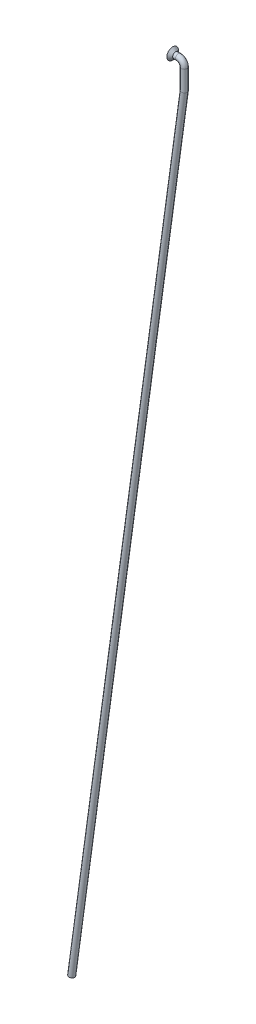
ISO-10303-21;
HEADER;
FILE_DESCRIPTION(('STEP AP214'),'2;1');
FILE_NAME('part.step','',(''),(''),'','','');
FILE_SCHEMA(('AUTOMOTIVE_DESIGN { 1 0 10303 214 1 1 1 1 }'));
ENDSEC;
DATA;
#1=APPLICATION_CONTEXT('core data for automotive mechanical design processes');
#2=APPLICATION_PROTOCOL_DEFINITION('international standard','automotive_design',2000,#1);
#3=PRODUCT_CONTEXT('',#1,'mechanical');
#4=PRODUCT('Part','Part','',(#3));
#5=PRODUCT_RELATED_PRODUCT_CATEGORY('part','',(#4));
#6=PRODUCT_DEFINITION_FORMATION('','',#4);
#7=PRODUCT_DEFINITION_CONTEXT('part definition',#1,'design');
#8=PRODUCT_DEFINITION('design','',#6,#7);
#9=PRODUCT_DEFINITION_SHAPE('','',#8);
#10=(LENGTH_UNIT() NAMED_UNIT(*) SI_UNIT(.MILLI.,.METRE.));
#11=(NAMED_UNIT(*) PLANE_ANGLE_UNIT() SI_UNIT($,.RADIAN.));
#12=(NAMED_UNIT(*) SI_UNIT($,.STERADIAN.) SOLID_ANGLE_UNIT());
#13=UNCERTAINTY_MEASURE_WITH_UNIT(LENGTH_MEASURE(1.E-05),#10,'distance_accuracy_value','');
#14=(GEOMETRIC_REPRESENTATION_CONTEXT(3) GLOBAL_UNCERTAINTY_ASSIGNED_CONTEXT((#13)) GLOBAL_UNIT_ASSIGNED_CONTEXT((#10,
#11,#12)) REPRESENTATION_CONTEXT('',''));
#15=CARTESIAN_POINT('',(0.,0.,0.));
#16=DIRECTION('',(0.,0.,1.));
#17=DIRECTION('',(1.,0.,0.));
#18=AXIS2_PLACEMENT_3D('',#15,#16,#17);
#19=CARTESIAN_POINT('',(1.17961196366423E-13,-9.00000000000038,0.));
#20=DIRECTION('',(-0.135542652249381,-0.990771512217255,0.));
#21=DIRECTION('',(0.990771512217224,-0.135542652249385,0.));
#22=AXIS2_PLACEMENT_3D('',#19,#20,#21);
#23=CYLINDRICAL_SURFACE('',#22,0.999999999999998);
#24=CARTESIAN_POINT('',(1.17961196366423E-13,-9.00000000000038,0.));
#25=DIRECTION('',(-0.0679282260285678,-0.997690210490551,0.));
#26=DIRECTION('',(0.997690210490517,-0.0679282260285706,0.));
#27=AXIS2_PLACEMENT_3D('',#24,#25,#26);
#28=ELLIPSE('',#27,1.00231513698861,0.999999999999998);
#29=CARTESIAN_POINT('',(1.00000000000012,-9.0680854891776,0.));
#30=VERTEX_POINT('',#29);
#31=EDGE_CURVE('E37',#30,#30,#28,.F.);
#32=ORIENTED_EDGE('',*,*,#31,.F.);
#33=EDGE_LOOP('',(#32));
#34=FACE_BOUND('',#33,.T.);
#35=CARTESIAN_POINT('',(-38.7761143552905,-292.440443433379,0.));
#36=DIRECTION('',(-0.135542652249381,-0.990771512217256,0.));
#37=DIRECTION('',(0.990771512217223,-0.135542652249385,0.));
#38=AXIS2_PLACEMENT_3D('',#35,#36,#37);
#39=CIRCLE('',#38,0.999999999999998);
#40=CARTESIAN_POINT('',(-37.7853428430733,-292.575986085628,0.));
#41=VERTEX_POINT('',#40);
#42=EDGE_CURVE('E11',#41,#41,#39,.T.);
#43=ORIENTED_EDGE('',*,*,#42,.F.);
#44=EDGE_LOOP('',(#43));
#45=FACE_BOUND('',#44,.T.);
#46=ADVANCED_FACE('F31',(#34,#45),#23,.T.);
#47=CARTESIAN_POINT('',(1.17961196366423E-13,-2.00000000000001,0.));
#48=DIRECTION('',(0.,-1.00000000000003,0.));
#49=DIRECTION('',(1.,0.,0.));
#50=AXIS2_PLACEMENT_3D('',#47,#48,#49);
#51=CYLINDRICAL_SURFACE('',#50,0.999999999999998);
#52=CARTESIAN_POINT('',(1.17961196366423E-13,-2.00000000000001,0.));
#53=DIRECTION('',(0.,-1.00000000000003,0.));
#54=DIRECTION('',(0.,0.,-1.00000000000003));
#55=AXIS2_PLACEMENT_3D('',#52,#53,#54);
#56=CIRCLE('',#55,0.999999999999998);
#57=CARTESIAN_POINT('',(1.00000000000011,-2.00000000000001,0.));
#58=VERTEX_POINT('',#57);
#59=EDGE_CURVE('E41',#58,#58,#56,.T.);
#60=ORIENTED_EDGE('',*,*,#59,.T.);
#61=EDGE_LOOP('',(#60));
#62=FACE_BOUND('',#61,.T.);
#63=ORIENTED_EDGE('',*,*,#31,.T.);
#64=EDGE_LOOP('',(#63));
#65=FACE_BOUND('',#64,.T.);
#66=ADVANCED_FACE('F74',(#62,#65),#51,.T.);
#67=CARTESIAN_POINT('',(-1.99999999999988,-2.00000000000003,0.));
#68=DIRECTION('',(0.,0.,-1.00000000000003));
#69=DIRECTION('',(-1.,0.,0.));
#70=AXIS2_PLACEMENT_3D('',#67,#68,#69);
#71=TOROIDAL_SURFACE('',#70,2.,0.999999999999998);
#72=CARTESIAN_POINT('',(-1.99999999999988,0.,0.));
#73=DIRECTION('',(1.,0.,0.));
#74=DIRECTION('',(0.,0.,-1.00000000000003));
#75=AXIS2_PLACEMENT_3D('',#72,#73,#74);
#76=CIRCLE('',#75,0.999999999999998);
#77=CARTESIAN_POINT('',(-1.99999999999988,0.999999999999972,0.));
#78=VERTEX_POINT('',#77);
#79=EDGE_CURVE('E45',#78,#78,#76,.T.);
#80=CARTESIAN_POINT('',(-1.99999999999988,-2.00000000000003,0.));
#81=DIRECTION('',(0.,0.,-1.00000000000003));
#82=DIRECTION('',(-1.,0.,0.));
#83=AXIS2_PLACEMENT_3D('',#80,#81,#82);
#84=CIRCLE('',#83,3.);
#85=EDGE_CURVE('',#78,#58,#84,.T.);
#86=ORIENTED_EDGE('',*,*,#79,.T.);
#87=ORIENTED_EDGE('',*,*,#59,.F.);
#88=ORIENTED_EDGE('',*,*,#85,.T.);
#89=ORIENTED_EDGE('',*,*,#85,.F.);
#90=EDGE_LOOP('',(#86,#88,#87,#89));
#91=FACE_BOUND('',#90,.T.);
#92=ADVANCED_FACE('F79',(#91),#71,.T.);
#93=CARTESIAN_POINT('',(-1.99999999999988,0.,0.));
#94=DIRECTION('',(-1.,0.,0.));
#95=DIRECTION('',(0.,-1.00000000000003,0.));
#96=AXIS2_PLACEMENT_3D('',#93,#94,#95);
#97=CYLINDRICAL_SURFACE('',#96,0.999999999999998);
#98=CARTESIAN_POINT('',(-2.99999999999988,0.,0.));
#99=DIRECTION('',(1.,0.,0.));
#100=DIRECTION('',(0.,1.00000000000003,0.));
#101=AXIS2_PLACEMENT_3D('',#98,#99,#100);
#102=CIRCLE('',#101,0.999999999999999);
#103=CARTESIAN_POINT('',(-2.99999999999988,1.00000000000003,0.));
#104=VERTEX_POINT('',#103);
#105=EDGE_CURVE('E53',#104,#104,#102,.T.);
#106=ORIENTED_EDGE('',*,*,#105,.T.);
#107=EDGE_LOOP('',(#106));
#108=FACE_BOUND('',#107,.T.);
#109=ORIENTED_EDGE('',*,*,#79,.F.);
#110=EDGE_LOOP('',(#109));
#111=FACE_BOUND('',#110,.T.);
#112=ADVANCED_FACE('F57',(#108,#111),#97,.T.);
#113=CARTESIAN_POINT('',(-38.7761143552905,-292.440443433379,0.));
#114=DIRECTION('',(-0.135542652249381,-0.990771512217256,0.));
#115=DIRECTION('',(0.990771512217223,-0.135542652249385,0.));
#116=AXIS2_PLACEMENT_3D('',#113,#114,#115);
#117=PLANE('',#116);
#118=ORIENTED_EDGE('',*,*,#42,.T.);
#119=EDGE_LOOP('',(#118));
#120=FACE_BOUND('',#119,.T.);
#121=ADVANCED_FACE('F63',(#120),#117,.T.);
#122=CARTESIAN_POINT('',(-2.99999999999988,0.,0.));
#123=DIRECTION('',(-1.,0.,0.));
#124=DIRECTION('',(0.,-1.00000000000003,0.));
#125=AXIS2_PLACEMENT_3D('',#122,#123,#124);
#126=CONICAL_SURFACE('',#125,0.999999999999999,0.785398163397449);
#127=CARTESIAN_POINT('',(-3.99999999999989,0.,0.));
#128=DIRECTION('',(1.,0.,0.));
#129=DIRECTION('',(0.,1.00000000000003,0.));
#130=AXIS2_PLACEMENT_3D('',#127,#128,#129);
#131=CIRCLE('',#130,2.);
#132=CARTESIAN_POINT('',(-3.99999999999989,2.00000000000006,0.));
#133=VERTEX_POINT('',#132);
#134=EDGE_CURVE('E50',#133,#133,#131,.T.);
#135=ORIENTED_EDGE('',*,*,#134,.T.);
#136=EDGE_LOOP('',(#135));
#137=FACE_BOUND('',#136,.T.);
#138=ORIENTED_EDGE('',*,*,#105,.F.);
#139=EDGE_LOOP('',(#138));
#140=FACE_BOUND('',#139,.T.);
#141=ADVANCED_FACE('F60',(#137,#140),#126,.T.);
#142=CARTESIAN_POINT('',(-3.99999999999989,0.,0.));
#143=DIRECTION('',(1.,0.,0.));
#144=DIRECTION('',(0.,0.,-1.00000000000003));
#145=AXIS2_PLACEMENT_3D('',#142,#143,#144);
#146=PLANE('',#145);
#147=ORIENTED_EDGE('',*,*,#134,.F.);
#148=EDGE_LOOP('',(#147));
#149=FACE_BOUND('',#148,.T.);
#150=ADVANCED_FACE('F62',(#149),#146,.F.);
#151=CLOSED_SHELL('',(#46,#66,#92,#112,#121,#141,#150));
#152=MANIFOLD_SOLID_BREP('B2',#151);
#153=ADVANCED_BREP_SHAPE_REPRESENTATION('',(#18,#152),#14);
#154=SHAPE_DEFINITION_REPRESENTATION(#9,#153);
ENDSEC;
END-ISO-10303-21;
